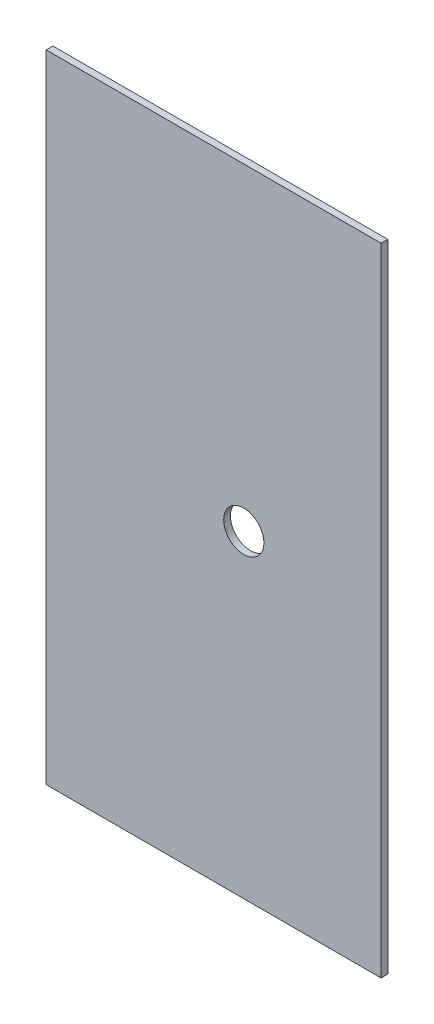
ISO-10303-21;
HEADER;
FILE_DESCRIPTION(('STEP AP214'),'2;1');
FILE_NAME('part.step','',(''),(''),'','','');
FILE_SCHEMA(('AUTOMOTIVE_DESIGN { 1 0 10303 214 1 1 1 1 }'));
ENDSEC;
DATA;
#1=APPLICATION_CONTEXT('core data for automotive mechanical design processes');
#2=APPLICATION_PROTOCOL_DEFINITION('international standard','automotive_design',2000,#1);
#3=PRODUCT_CONTEXT('',#1,'mechanical');
#4=PRODUCT('Part','Part','',(#3));
#5=PRODUCT_RELATED_PRODUCT_CATEGORY('part','',(#4));
#6=PRODUCT_DEFINITION_FORMATION('','',#4);
#7=PRODUCT_DEFINITION_CONTEXT('part definition',#1,'design');
#8=PRODUCT_DEFINITION('design','',#6,#7);
#9=PRODUCT_DEFINITION_SHAPE('','',#8);
#10=(LENGTH_UNIT() NAMED_UNIT(*) SI_UNIT(.MILLI.,.METRE.));
#11=(NAMED_UNIT(*) PLANE_ANGLE_UNIT() SI_UNIT($,.RADIAN.));
#12=(NAMED_UNIT(*) SI_UNIT($,.STERADIAN.) SOLID_ANGLE_UNIT());
#13=UNCERTAINTY_MEASURE_WITH_UNIT(LENGTH_MEASURE(1.E-05),#10,'distance_accuracy_value','');
#14=(GEOMETRIC_REPRESENTATION_CONTEXT(3) GLOBAL_UNCERTAINTY_ASSIGNED_CONTEXT((#13)) GLOBAL_UNIT_ASSIGNED_CONTEXT((#10,
#11,#12)) REPRESENTATION_CONTEXT('',''));
#15=CARTESIAN_POINT('',(0.,0.,0.));
#16=DIRECTION('',(0.,0.,1.));
#17=DIRECTION('',(1.,0.,0.));
#18=AXIS2_PLACEMENT_3D('',#15,#16,#17);
#19=CARTESIAN_POINT('',(50.,-95.,2.));
#20=DIRECTION('',(-1.,0.,0.));
#21=DIRECTION('',(0.,0.,1.));
#22=AXIS2_PLACEMENT_3D('',#19,#20,#21);
#23=PLANE('',#22);
#24=DIRECTION('',(0.,1.,0.));
#25=VECTOR('',#24,1.);
#26=CARTESIAN_POINT('',(50.,-95.,0.));
#27=LINE('',#26,#25);
#28=CARTESIAN_POINT('',(50.,-95.,0.));
#29=VERTEX_POINT('',#28);
#30=CARTESIAN_POINT('',(50.,95.,0.));
#31=VERTEX_POINT('',#30);
#32=EDGE_CURVE('E96',#29,#31,#27,.T.);
#33=ORIENTED_EDGE('',*,*,#32,.T.);
#34=DIRECTION('',(0.,0.,-1.));
#35=VECTOR('',#34,1.);
#36=CARTESIAN_POINT('',(50.,95.,2.));
#37=LINE('',#36,#35);
#38=CARTESIAN_POINT('',(50.,95.,2.));
#39=VERTEX_POINT('',#38);
#40=EDGE_CURVE('E11',#39,#31,#37,.T.);
#41=ORIENTED_EDGE('',*,*,#40,.F.);
#42=DIRECTION('',(0.,1.,0.));
#43=VECTOR('',#42,1.);
#44=CARTESIAN_POINT('',(50.,-95.,2.));
#45=LINE('',#44,#43);
#46=CARTESIAN_POINT('',(50.,-95.,2.));
#47=VERTEX_POINT('',#46);
#48=EDGE_CURVE('E84',#47,#39,#45,.T.);
#49=ORIENTED_EDGE('',*,*,#48,.F.);
#50=DIRECTION('',(0.,0.,-1.));
#51=VECTOR('',#50,1.);
#52=CARTESIAN_POINT('',(50.,-95.,2.));
#53=LINE('',#52,#51);
#54=EDGE_CURVE('E92',#47,#29,#53,.T.);
#55=ORIENTED_EDGE('',*,*,#54,.T.);
#56=EDGE_LOOP('',(#33,#41,#49,#55));
#57=FACE_BOUND('',#56,.T.);
#58=ADVANCED_FACE('F33',(#57),#23,.F.);
#59=CARTESIAN_POINT('',(-50.,95.,2.));
#60=DIRECTION('',(0.,-1.,0.));
#61=DIRECTION('',(0.,0.,-1.));
#62=AXIS2_PLACEMENT_3D('',#59,#60,#61);
#63=PLANE('',#62);
#64=DIRECTION('',(-1.,0.,0.));
#65=VECTOR('',#64,1.);
#66=CARTESIAN_POINT('',(-50.,95.,0.));
#67=LINE('',#66,#65);
#68=CARTESIAN_POINT('',(-50.,95.,0.));
#69=VERTEX_POINT('',#68);
#70=EDGE_CURVE('E88',#31,#69,#67,.T.);
#71=ORIENTED_EDGE('',*,*,#70,.T.);
#72=DIRECTION('',(0.,0.,-1.));
#73=VECTOR('',#72,1.);
#74=CARTESIAN_POINT('',(-50.,95.,2.));
#75=LINE('',#74,#73);
#76=CARTESIAN_POINT('',(-50.,95.,2.));
#77=VERTEX_POINT('',#76);
#78=EDGE_CURVE('E41',#77,#69,#75,.T.);
#79=ORIENTED_EDGE('',*,*,#78,.F.);
#80=DIRECTION('',(-1.,0.,0.));
#81=VECTOR('',#80,1.);
#82=CARTESIAN_POINT('',(-50.,95.,2.));
#83=LINE('',#82,#81);
#84=EDGE_CURVE('E79',#39,#77,#83,.T.);
#85=ORIENTED_EDGE('',*,*,#84,.F.);
#86=ORIENTED_EDGE('',*,*,#40,.T.);
#87=EDGE_LOOP('',(#71,#79,#85,#86));
#88=FACE_BOUND('',#87,.T.);
#89=ADVANCED_FACE('F87',(#88),#63,.F.);
#90=CARTESIAN_POINT('',(-50.,-95.,2.));
#91=DIRECTION('',(1.,0.,0.));
#92=DIRECTION('',(0.,0.,-1.));
#93=AXIS2_PLACEMENT_3D('',#90,#91,#92);
#94=PLANE('',#93);
#95=DIRECTION('',(0.,-1.,0.));
#96=VECTOR('',#95,1.);
#97=CARTESIAN_POINT('',(-50.,-95.,0.));
#98=LINE('',#97,#96);
#99=CARTESIAN_POINT('',(-50.,-95.,0.));
#100=VERTEX_POINT('',#99);
#101=EDGE_CURVE('E66',#69,#100,#98,.T.);
#102=ORIENTED_EDGE('',*,*,#101,.T.);
#103=DIRECTION('',(0.,0.,-1.));
#104=VECTOR('',#103,1.);
#105=CARTESIAN_POINT('',(-50.,-95.,2.));
#106=LINE('',#105,#104);
#107=CARTESIAN_POINT('',(-50.,-95.,2.));
#108=VERTEX_POINT('',#107);
#109=EDGE_CURVE('E89',#108,#100,#106,.T.);
#110=ORIENTED_EDGE('',*,*,#109,.F.);
#111=DIRECTION('',(0.,-1.,0.));
#112=VECTOR('',#111,1.);
#113=CARTESIAN_POINT('',(-50.,-95.,2.));
#114=LINE('',#113,#112);
#115=EDGE_CURVE('E82',#77,#108,#114,.T.);
#116=ORIENTED_EDGE('',*,*,#115,.F.);
#117=ORIENTED_EDGE('',*,*,#78,.T.);
#118=EDGE_LOOP('',(#102,#110,#116,#117));
#119=FACE_BOUND('',#118,.T.);
#120=ADVANCED_FACE('F90',(#119),#94,.F.);
#121=CARTESIAN_POINT('',(-50.,-95.,2.));
#122=DIRECTION('',(0.,1.,0.));
#123=DIRECTION('',(0.,0.,1.));
#124=AXIS2_PLACEMENT_3D('',#121,#122,#123);
#125=PLANE('',#124);
#126=DIRECTION('',(1.,0.,0.));
#127=VECTOR('',#126,1.);
#128=CARTESIAN_POINT('',(-50.,-95.,0.));
#129=LINE('',#128,#127);
#130=EDGE_CURVE('E72',#100,#29,#129,.T.);
#131=ORIENTED_EDGE('',*,*,#130,.T.);
#132=ORIENTED_EDGE('',*,*,#54,.F.);
#133=DIRECTION('',(1.,0.,0.));
#134=VECTOR('',#133,1.);
#135=CARTESIAN_POINT('',(-50.,-95.,2.));
#136=LINE('',#135,#134);
#137=EDGE_CURVE('E49',#108,#47,#136,.T.);
#138=ORIENTED_EDGE('',*,*,#137,.F.);
#139=ORIENTED_EDGE('',*,*,#109,.T.);
#140=EDGE_LOOP('',(#131,#132,#138,#139));
#141=FACE_BOUND('',#140,.T.);
#142=ADVANCED_FACE('F104',(#141),#125,.F.);
#143=CARTESIAN_POINT('',(0.,0.,2.));
#144=DIRECTION('',(0.,0.,-1.));
#145=DIRECTION('',(-1.,0.,0.));
#146=AXIS2_PLACEMENT_3D('',#143,#144,#145);
#147=PLANE('',#146);
#148=CARTESIAN_POINT('',(9.00000000000034,2.22044604925031E-13,2.));
#149=DIRECTION('',(0.,0.,-1.));
#150=DIRECTION('',(-1.,0.,0.));
#151=AXIS2_PLACEMENT_3D('',#148,#149,#150);
#152=CIRCLE('',#151,6.);
#153=CARTESIAN_POINT('',(3.00000000000034,2.22044604925031E-13,2.));
#154=VERTEX_POINT('',#153);
#155=EDGE_CURVE('E99',#154,#154,#152,.T.);
#156=ORIENTED_EDGE('',*,*,#155,.T.);
#157=EDGE_LOOP('',(#156));
#158=FACE_BOUND('',#157,.T.);
#159=ORIENTED_EDGE('',*,*,#48,.T.);
#160=ORIENTED_EDGE('',*,*,#84,.T.);
#161=ORIENTED_EDGE('',*,*,#115,.T.);
#162=ORIENTED_EDGE('',*,*,#137,.T.);
#163=EDGE_LOOP('',(#159,#160,#161,#162));
#164=FACE_BOUND('',#163,.T.);
#165=ADVANCED_FACE('F80',(#158,#164),#147,.F.);
#166=CARTESIAN_POINT('',(0.,0.,0.));
#167=DIRECTION('',(0.,0.,-1.));
#168=DIRECTION('',(-1.,0.,0.));
#169=AXIS2_PLACEMENT_3D('',#166,#167,#168);
#170=PLANE('',#169);
#171=CARTESIAN_POINT('',(9.00000000000034,2.22044604925031E-13,0.));
#172=DIRECTION('',(0.,0.,-1.));
#173=DIRECTION('',(-1.,0.,0.));
#174=AXIS2_PLACEMENT_3D('',#171,#172,#173);
#175=CIRCLE('',#174,6.);
#176=CARTESIAN_POINT('',(3.00000000000034,2.22044604925031E-13,0.));
#177=VERTEX_POINT('',#176);
#178=EDGE_CURVE('E110',#177,#177,#175,.T.);
#179=ORIENTED_EDGE('',*,*,#178,.F.);
#180=EDGE_LOOP('',(#179));
#181=FACE_BOUND('',#180,.T.);
#182=ORIENTED_EDGE('',*,*,#32,.F.);
#183=ORIENTED_EDGE('',*,*,#130,.F.);
#184=ORIENTED_EDGE('',*,*,#101,.F.);
#185=ORIENTED_EDGE('',*,*,#70,.F.);
#186=EDGE_LOOP('',(#182,#183,#184,#185));
#187=FACE_BOUND('',#186,.T.);
#188=ADVANCED_FACE('F107',(#181,#187),#170,.T.);
#189=CARTESIAN_POINT('',(9.00000000000034,2.22044604925031E-13,2.));
#190=DIRECTION('',(0.,0.,-1.));
#191=DIRECTION('',(-1.,0.,0.));
#192=AXIS2_PLACEMENT_3D('',#189,#190,#191);
#193=CYLINDRICAL_SURFACE('',#192,6.);
#194=ORIENTED_EDGE('',*,*,#155,.F.);
#195=EDGE_LOOP('',(#194));
#196=FACE_BOUND('',#195,.T.);
#197=ORIENTED_EDGE('',*,*,#178,.T.);
#198=EDGE_LOOP('',(#197));
#199=FACE_BOUND('',#198,.T.);
#200=ADVANCED_FACE('F117',(#196,#199),#193,.F.);
#201=CLOSED_SHELL('',(#58,#89,#120,#142,#165,#188,#200));
#202=MANIFOLD_SOLID_BREP('B2',#201);
#203=ADVANCED_BREP_SHAPE_REPRESENTATION('',(#18,#202),#14);
#204=SHAPE_DEFINITION_REPRESENTATION(#9,#203);
ENDSEC;
END-ISO-10303-21;
